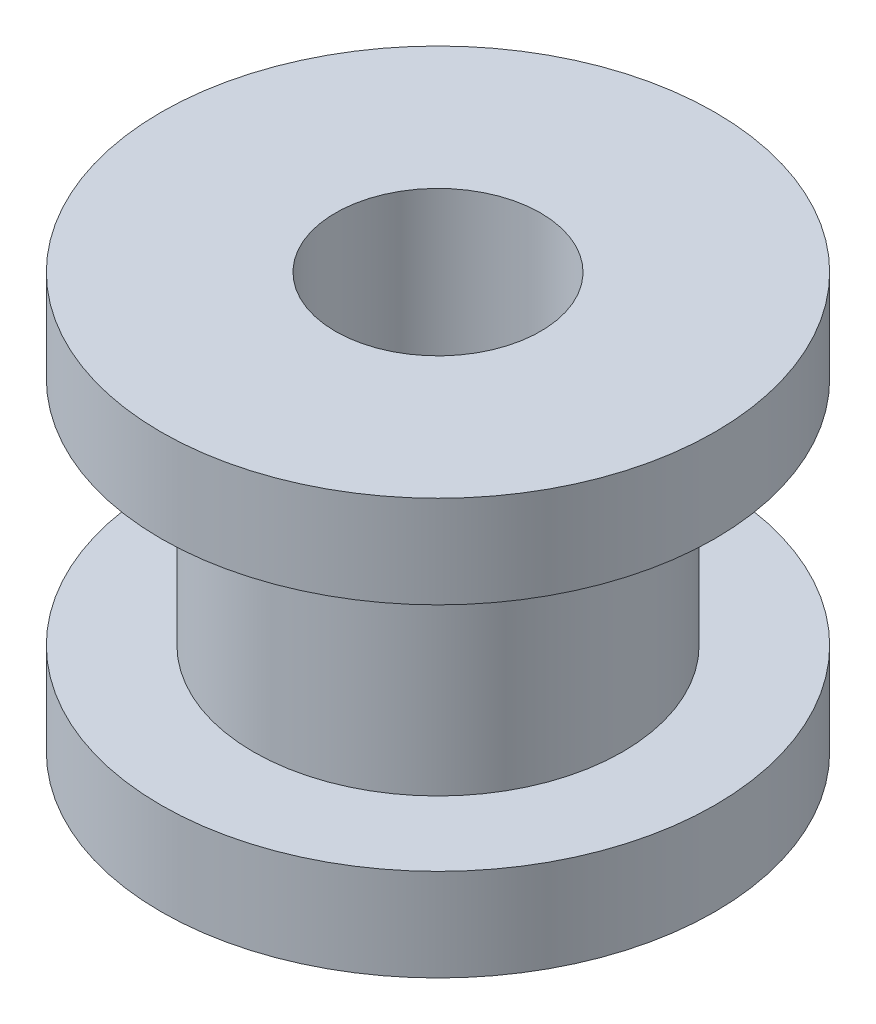
ISO-10303-21;
HEADER;
FILE_DESCRIPTION(('STEP AP214'),'2;1');
FILE_NAME('part.step','',(''),(''),'','','');
FILE_SCHEMA(('AUTOMOTIVE_DESIGN { 1 0 10303 214 1 1 1 1 }'));
ENDSEC;
DATA;
#1=APPLICATION_CONTEXT('core data for automotive mechanical design processes');
#2=APPLICATION_PROTOCOL_DEFINITION('international standard','automotive_design',2000,#1);
#3=PRODUCT_CONTEXT('',#1,'mechanical');
#4=PRODUCT('Part','Part','',(#3));
#5=PRODUCT_RELATED_PRODUCT_CATEGORY('part','',(#4));
#6=PRODUCT_DEFINITION_FORMATION('','',#4);
#7=PRODUCT_DEFINITION_CONTEXT('part definition',#1,'design');
#8=PRODUCT_DEFINITION('design','',#6,#7);
#9=PRODUCT_DEFINITION_SHAPE('','',#8);
#10=(LENGTH_UNIT() NAMED_UNIT(*) SI_UNIT(.MILLI.,.METRE.));
#11=(NAMED_UNIT(*) PLANE_ANGLE_UNIT() SI_UNIT($,.RADIAN.));
#12=(NAMED_UNIT(*) SI_UNIT($,.STERADIAN.) SOLID_ANGLE_UNIT());
#13=UNCERTAINTY_MEASURE_WITH_UNIT(LENGTH_MEASURE(1.E-05),#10,'distance_accuracy_value','');
#14=(GEOMETRIC_REPRESENTATION_CONTEXT(3) GLOBAL_UNCERTAINTY_ASSIGNED_CONTEXT((#13)) GLOBAL_UNIT_ASSIGNED_CONTEXT((#10,
#11,#12)) REPRESENTATION_CONTEXT('',''));
#15=CARTESIAN_POINT('',(0.,0.,0.));
#16=DIRECTION('',(0.,0.,1.));
#17=DIRECTION('',(1.,0.,0.));
#18=AXIS2_PLACEMENT_3D('',#15,#16,#17);
#19=CARTESIAN_POINT('',(0.,5.,0.));
#20=DIRECTION('',(0.,-1.,0.));
#21=DIRECTION('',(0.,0.,-1.));
#22=AXIS2_PLACEMENT_3D('',#19,#20,#21);
#23=CYLINDRICAL_SURFACE('',#22,4.);
#24=CARTESIAN_POINT('',(0.,5.,0.));
#25=DIRECTION('',(0.,1.,0.));
#26=DIRECTION('',(0.,0.,1.));
#27=AXIS2_PLACEMENT_3D('',#24,#25,#26);
#28=CIRCLE('',#27,4.);
#29=CARTESIAN_POINT('',(0.,5.,4.));
#30=VERTEX_POINT('',#29);
#31=EDGE_CURVE('E10',#30,#30,#28,.T.);
#32=ORIENTED_EDGE('',*,*,#31,.F.);
#33=EDGE_LOOP('',(#32));
#34=FACE_BOUND('',#33,.T.);
#35=CARTESIAN_POINT('',(0.,0.,0.));
#36=DIRECTION('',(0.,1.,0.));
#37=DIRECTION('',(0.,0.,1.));
#38=AXIS2_PLACEMENT_3D('',#35,#36,#37);
#39=CIRCLE('',#38,4.);
#40=CARTESIAN_POINT('',(0.,0.,4.));
#41=VERTEX_POINT('',#40);
#42=EDGE_CURVE('E38',#41,#41,#39,.T.);
#43=ORIENTED_EDGE('',*,*,#42,.T.);
#44=EDGE_LOOP('',(#43));
#45=FACE_BOUND('',#44,.T.);
#46=ADVANCED_FACE('F35',(#34,#45),#23,.T.);
#47=CARTESIAN_POINT('',(0.,7.,0.));
#48=DIRECTION('',(0.,-1.,0.));
#49=DIRECTION('',(0.,0.,-1.));
#50=AXIS2_PLACEMENT_3D('',#47,#48,#49);
#51=CYLINDRICAL_SURFACE('',#50,6.);
#52=CARTESIAN_POINT('',(0.,7.,0.));
#53=DIRECTION('',(0.,1.,0.));
#54=DIRECTION('',(0.,0.,1.));
#55=AXIS2_PLACEMENT_3D('',#52,#53,#54);
#56=CIRCLE('',#55,6.);
#57=CARTESIAN_POINT('',(0.,7.,6.));
#58=VERTEX_POINT('',#57);
#59=EDGE_CURVE('E42',#58,#58,#56,.T.);
#60=ORIENTED_EDGE('',*,*,#59,.F.);
#61=EDGE_LOOP('',(#60));
#62=FACE_BOUND('',#61,.T.);
#63=CARTESIAN_POINT('',(0.,5.,0.));
#64=DIRECTION('',(0.,1.,0.));
#65=DIRECTION('',(0.,0.,1.));
#66=AXIS2_PLACEMENT_3D('',#63,#64,#65);
#67=CIRCLE('',#66,6.);
#68=CARTESIAN_POINT('',(0.,5.,6.));
#69=VERTEX_POINT('',#68);
#70=EDGE_CURVE('E46',#69,#69,#67,.T.);
#71=ORIENTED_EDGE('',*,*,#70,.T.);
#72=EDGE_LOOP('',(#71));
#73=FACE_BOUND('',#72,.T.);
#74=ADVANCED_FACE('F78',(#62,#73),#51,.T.);
#75=CARTESIAN_POINT('',(0.,7.,0.));
#76=DIRECTION('',(0.,1.,0.));
#77=DIRECTION('',(0.,0.,1.));
#78=AXIS2_PLACEMENT_3D('',#75,#76,#77);
#79=PLANE('',#78);
#80=CARTESIAN_POINT('',(0.,7.,0.));
#81=DIRECTION('',(0.,1.,0.));
#82=DIRECTION('',(0.,0.,1.));
#83=AXIS2_PLACEMENT_3D('',#80,#81,#82);
#84=CIRCLE('',#83,2.2225);
#85=CARTESIAN_POINT('',(0.,7.,2.2225));
#86=VERTEX_POINT('',#85);
#87=EDGE_CURVE('E58',#86,#86,#84,.T.);
#88=ORIENTED_EDGE('',*,*,#87,.F.);
#89=EDGE_LOOP('',(#88));
#90=FACE_BOUND('',#89,.T.);
#91=ORIENTED_EDGE('',*,*,#59,.T.);
#92=EDGE_LOOP('',(#91));
#93=FACE_BOUND('',#92,.T.);
#94=ADVANCED_FACE('F74',(#90,#93),#79,.T.);
#95=CARTESIAN_POINT('',(0.,5.,0.));
#96=DIRECTION('',(0.,1.,0.));
#97=DIRECTION('',(0.,0.,1.));
#98=AXIS2_PLACEMENT_3D('',#95,#96,#97);
#99=PLANE('',#98);
#100=ORIENTED_EDGE('',*,*,#31,.T.);
#101=EDGE_LOOP('',(#100));
#102=FACE_BOUND('',#101,.T.);
#103=ORIENTED_EDGE('',*,*,#70,.F.);
#104=EDGE_LOOP('',(#103));
#105=FACE_BOUND('',#104,.T.);
#106=ADVANCED_FACE('F77',(#102,#105),#99,.F.);
#107=CARTESIAN_POINT('',(0.,-2.,0.));
#108=DIRECTION('',(0.,1.,0.));
#109=DIRECTION('',(0.,0.,1.));
#110=AXIS2_PLACEMENT_3D('',#107,#108,#109);
#111=CYLINDRICAL_SURFACE('',#110,6.);
#112=CARTESIAN_POINT('',(0.,-2.,0.));
#113=DIRECTION('',(0.,1.,0.));
#114=DIRECTION('',(0.,0.,1.));
#115=AXIS2_PLACEMENT_3D('',#112,#113,#114);
#116=CIRCLE('',#115,6.);
#117=CARTESIAN_POINT('',(0.,-2.,6.));
#118=VERTEX_POINT('',#117);
#119=EDGE_CURVE('E54',#118,#118,#116,.T.);
#120=ORIENTED_EDGE('',*,*,#119,.T.);
#121=EDGE_LOOP('',(#120));
#122=FACE_BOUND('',#121,.T.);
#123=CARTESIAN_POINT('',(0.,0.,0.));
#124=DIRECTION('',(0.,1.,0.));
#125=DIRECTION('',(0.,0.,1.));
#126=AXIS2_PLACEMENT_3D('',#123,#124,#125);
#127=CIRCLE('',#126,6.);
#128=CARTESIAN_POINT('',(0.,0.,6.));
#129=VERTEX_POINT('',#128);
#130=EDGE_CURVE('E51',#129,#129,#127,.T.);
#131=ORIENTED_EDGE('',*,*,#130,.F.);
#132=EDGE_LOOP('',(#131));
#133=FACE_BOUND('',#132,.T.);
#134=ADVANCED_FACE('F87',(#122,#133),#111,.T.);
#135=CARTESIAN_POINT('',(0.,-2.,0.));
#136=DIRECTION('',(0.,-1.,0.));
#137=DIRECTION('',(0.,0.,1.));
#138=AXIS2_PLACEMENT_3D('',#135,#136,#137);
#139=PLANE('',#138);
#140=CARTESIAN_POINT('',(0.,-2.,0.));
#141=DIRECTION('',(0.,1.,0.));
#142=DIRECTION('',(0.,0.,1.));
#143=AXIS2_PLACEMENT_3D('',#140,#141,#142);
#144=CIRCLE('',#143,2.2225);
#145=CARTESIAN_POINT('',(0.,-2.,2.2225));
#146=VERTEX_POINT('',#145);
#147=EDGE_CURVE('E55',#146,#146,#144,.T.);
#148=ORIENTED_EDGE('',*,*,#147,.T.);
#149=EDGE_LOOP('',(#148));
#150=FACE_BOUND('',#149,.T.);
#151=ORIENTED_EDGE('',*,*,#119,.F.);
#152=EDGE_LOOP('',(#151));
#153=FACE_BOUND('',#152,.T.);
#154=ADVANCED_FACE('F64',(#150,#153),#139,.T.);
#155=CARTESIAN_POINT('',(0.,0.,0.));
#156=DIRECTION('',(0.,-1.,0.));
#157=DIRECTION('',(0.,0.,1.));
#158=AXIS2_PLACEMENT_3D('',#155,#156,#157);
#159=PLANE('',#158);
#160=ORIENTED_EDGE('',*,*,#42,.F.);
#161=EDGE_LOOP('',(#160));
#162=FACE_BOUND('',#161,.T.);
#163=ORIENTED_EDGE('',*,*,#130,.T.);
#164=EDGE_LOOP('',(#163));
#165=FACE_BOUND('',#164,.T.);
#166=ADVANCED_FACE('F70',(#162,#165),#159,.F.);
#167=CARTESIAN_POINT('',(0.,-2.,0.));
#168=DIRECTION('',(0.,1.,0.));
#169=DIRECTION('',(0.,0.,1.));
#170=AXIS2_PLACEMENT_3D('',#167,#168,#169);
#171=CYLINDRICAL_SURFACE('',#170,2.2225);
#172=ORIENTED_EDGE('',*,*,#147,.F.);
#173=EDGE_LOOP('',(#172));
#174=FACE_BOUND('',#173,.T.);
#175=ORIENTED_EDGE('',*,*,#87,.T.);
#176=EDGE_LOOP('',(#175));
#177=FACE_BOUND('',#176,.T.);
#178=ADVANCED_FACE('F67',(#174,#177),#171,.F.);
#179=CLOSED_SHELL('',(#46,#74,#94,#106,#134,#154,#166,#178));
#180=MANIFOLD_SOLID_BREP('B2',#179);
#181=ADVANCED_BREP_SHAPE_REPRESENTATION('',(#18,#180),#14);
#182=SHAPE_DEFINITION_REPRESENTATION(#9,#181);
ENDSEC;
END-ISO-10303-21;
